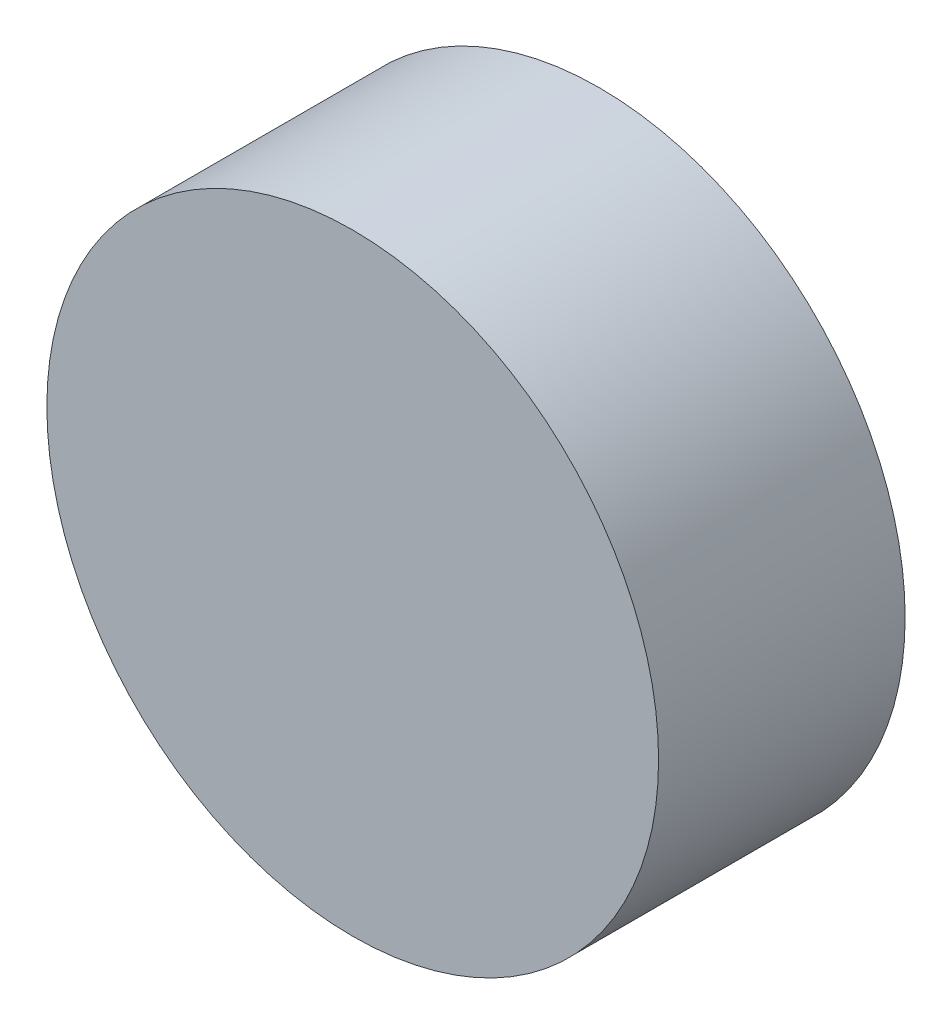
ISO-10303-21;
HEADER;
FILE_DESCRIPTION(('STEP AP214'),'2;1');
FILE_NAME('part.step','',(''),(''),'','','');
FILE_SCHEMA(('AUTOMOTIVE_DESIGN { 1 0 10303 214 1 1 1 1 }'));
ENDSEC;
DATA;
#1=APPLICATION_CONTEXT('core data for automotive mechanical design processes');
#2=APPLICATION_PROTOCOL_DEFINITION('international standard','automotive_design',2000,#1);
#3=PRODUCT_CONTEXT('',#1,'mechanical');
#4=PRODUCT('Part','Part','',(#3));
#5=PRODUCT_RELATED_PRODUCT_CATEGORY('part','',(#4));
#6=PRODUCT_DEFINITION_FORMATION('','',#4);
#7=PRODUCT_DEFINITION_CONTEXT('part definition',#1,'design');
#8=PRODUCT_DEFINITION('design','',#6,#7);
#9=PRODUCT_DEFINITION_SHAPE('','',#8);
#10=(LENGTH_UNIT() NAMED_UNIT(*) SI_UNIT(.MILLI.,.METRE.));
#11=(NAMED_UNIT(*) PLANE_ANGLE_UNIT() SI_UNIT($,.RADIAN.));
#12=(NAMED_UNIT(*) SI_UNIT($,.STERADIAN.) SOLID_ANGLE_UNIT());
#13=UNCERTAINTY_MEASURE_WITH_UNIT(LENGTH_MEASURE(1.E-05),#10,'distance_accuracy_value','');
#14=(GEOMETRIC_REPRESENTATION_CONTEXT(3) GLOBAL_UNCERTAINTY_ASSIGNED_CONTEXT((#13)) GLOBAL_UNIT_ASSIGNED_CONTEXT((#10,
#11,#12)) REPRESENTATION_CONTEXT('',''));
#15=CARTESIAN_POINT('',(0.,0.,0.));
#16=DIRECTION('',(0.,0.,1.));
#17=DIRECTION('',(1.,0.,0.));
#18=AXIS2_PLACEMENT_3D('',#15,#16,#17);
#19=CARTESIAN_POINT('',(291.098437524259,204.55,46.1581797782766));
#20=DIRECTION('',(0.,0.,-1.));
#21=DIRECTION('',(-1.,0.,0.));
#22=AXIS2_PLACEMENT_3D('',#19,#20,#21);
#23=CYLINDRICAL_SURFACE('',#22,12.7);
#24=CARTESIAN_POINT('',(291.098437524259,204.55,0.));
#25=DIRECTION('',(0.,0.,1.));
#26=DIRECTION('',(1.,0.,0.));
#27=AXIS2_PLACEMENT_3D('',#24,#25,#26);
#28=CIRCLE('',#27,12.7);
#29=CARTESIAN_POINT('',(303.798437524259,204.55,0.));
#30=VERTEX_POINT('',#29);
#31=EDGE_CURVE('E45',#30,#30,#28,.T.);
#32=ORIENTED_EDGE('',*,*,#31,.T.);
#33=EDGE_LOOP('',(#32));
#34=FACE_BOUND('',#33,.T.);
#35=CARTESIAN_POINT('',(291.098437524259,204.55,10.237155294));
#36=DIRECTION('',(0.,0.,1.));
#37=DIRECTION('',(1.,0.,0.));
#38=AXIS2_PLACEMENT_3D('',#35,#36,#37);
#39=CIRCLE('',#38,12.7);
#40=CARTESIAN_POINT('',(303.798437524259,204.55,10.237155294));
#41=VERTEX_POINT('',#40);
#42=EDGE_CURVE('E10',#41,#41,#39,.T.);
#43=ORIENTED_EDGE('',*,*,#42,.F.);
#44=EDGE_LOOP('',(#43));
#45=FACE_BOUND('',#44,.T.);
#46=ADVANCED_FACE('F37',(#34,#45),#23,.T.);
#47=CARTESIAN_POINT('',(291.098437524259,204.55,0.));
#48=DIRECTION('',(0.,0.,1.));
#49=DIRECTION('',(1.,0.,0.));
#50=AXIS2_PLACEMENT_3D('',#47,#48,#49);
#51=PLANE('',#50);
#52=ORIENTED_EDGE('',*,*,#31,.F.);
#53=EDGE_LOOP('',(#52));
#54=FACE_BOUND('',#53,.T.);
#55=ADVANCED_FACE('F54',(#54),#51,.F.);
#56=CARTESIAN_POINT('',(278.601637524259,82.2490000000001,10.237155294));
#57=DIRECTION('',(0.,0.,1.));
#58=DIRECTION('',(0.,-1.,0.));
#59=AXIS2_PLACEMENT_3D('',#56,#57,#58);
#60=PLANE('',#59);
#61=ORIENTED_EDGE('',*,*,#42,.T.);
#62=EDGE_LOOP('',(#61));
#63=FACE_BOUND('',#62,.T.);
#64=ADVANCED_FACE('F39',(#63),#60,.T.);
#65=CLOSED_SHELL('',(#46,#55,#64));
#66=MANIFOLD_SOLID_BREP('B2',#65);
#67=ADVANCED_BREP_SHAPE_REPRESENTATION('',(#18,#66),#14);
#68=SHAPE_DEFINITION_REPRESENTATION(#9,#67);
ENDSEC;
END-ISO-10303-21;
